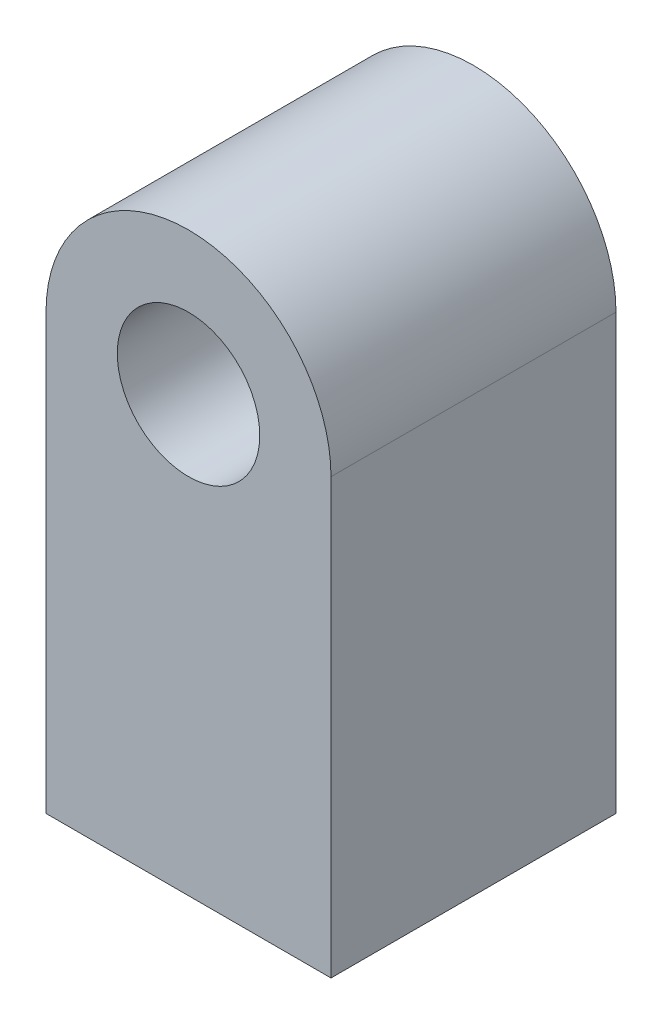
ISO-10303-21;
HEADER;
FILE_DESCRIPTION(('STEP AP214'),'2;1');
FILE_NAME('part.step','',(''),(''),'','','');
FILE_SCHEMA(('AUTOMOTIVE_DESIGN { 1 0 10303 214 1 1 1 1 }'));
ENDSEC;
DATA;
#1=APPLICATION_CONTEXT('core data for automotive mechanical design processes');
#2=APPLICATION_PROTOCOL_DEFINITION('international standard','automotive_design',2000,#1);
#3=PRODUCT_CONTEXT('',#1,'mechanical');
#4=PRODUCT('Part','Part','',(#3));
#5=PRODUCT_RELATED_PRODUCT_CATEGORY('part','',(#4));
#6=PRODUCT_DEFINITION_FORMATION('','',#4);
#7=PRODUCT_DEFINITION_CONTEXT('part definition',#1,'design');
#8=PRODUCT_DEFINITION('design','',#6,#7);
#9=PRODUCT_DEFINITION_SHAPE('','',#8);
#10=(LENGTH_UNIT() NAMED_UNIT(*) SI_UNIT(.MILLI.,.METRE.));
#11=(NAMED_UNIT(*) PLANE_ANGLE_UNIT() SI_UNIT($,.RADIAN.));
#12=(NAMED_UNIT(*) SI_UNIT($,.STERADIAN.) SOLID_ANGLE_UNIT());
#13=UNCERTAINTY_MEASURE_WITH_UNIT(LENGTH_MEASURE(1.E-05),#10,'distance_accuracy_value','');
#14=(GEOMETRIC_REPRESENTATION_CONTEXT(3) GLOBAL_UNCERTAINTY_ASSIGNED_CONTEXT((#13)) GLOBAL_UNIT_ASSIGNED_CONTEXT((#10,
#11,#12)) REPRESENTATION_CONTEXT('',''));
#15=CARTESIAN_POINT('',(0.,0.,0.));
#16=DIRECTION('',(0.,0.,1.));
#17=DIRECTION('',(1.,0.,0.));
#18=AXIS2_PLACEMENT_3D('',#15,#16,#17);
#19=CARTESIAN_POINT('',(0.,121.875,40.));
#20=DIRECTION('',(0.,0.,-1.));
#21=DIRECTION('',(-1.,0.,0.));
#22=AXIS2_PLACEMENT_3D('',#19,#20,#21);
#23=PLANE('',#22);
#24=DIRECTION('',(1.,0.,0.));
#25=VECTOR('',#24,1.);
#26=CARTESIAN_POINT('',(0.,0.,40.));
#27=LINE('',#26,#25);
#28=CARTESIAN_POINT('',(-40.,0.,40.));
#29=VERTEX_POINT('',#28);
#30=CARTESIAN_POINT('',(40.,0.,40.));
#31=VERTEX_POINT('',#30);
#32=EDGE_CURVE('E80',#29,#31,#27,.T.);
#33=ORIENTED_EDGE('',*,*,#32,.T.);
#34=DIRECTION('',(0.,1.,0.));
#35=VECTOR('',#34,1.);
#36=CARTESIAN_POINT('',(40.,0.,40.));
#37=LINE('',#36,#35);
#38=CARTESIAN_POINT('',(40.,121.875,40.));
#39=VERTEX_POINT('',#38);
#40=EDGE_CURVE('E83',#31,#39,#37,.T.);
#41=ORIENTED_EDGE('',*,*,#40,.T.);
#42=CARTESIAN_POINT('',(0.,121.875,40.));
#43=DIRECTION('',(0.,0.,1.));
#44=DIRECTION('',(-1.,0.,0.));
#45=AXIS2_PLACEMENT_3D('',#42,#43,#44);
#46=CIRCLE('',#45,40.);
#47=CARTESIAN_POINT('',(-40.,121.875,40.));
#48=VERTEX_POINT('',#47);
#49=EDGE_CURVE('E87',#39,#48,#46,.T.);
#50=ORIENTED_EDGE('',*,*,#49,.T.);
#51=DIRECTION('',(0.,-1.,0.));
#52=VECTOR('',#51,1.);
#53=CARTESIAN_POINT('',(-40.,0.,40.));
#54=LINE('',#53,#52);
#55=EDGE_CURVE('E51',#48,#29,#54,.T.);
#56=ORIENTED_EDGE('',*,*,#55,.T.);
#57=EDGE_LOOP('',(#33,#41,#50,#56));
#58=FACE_BOUND('',#57,.T.);
#59=CARTESIAN_POINT('',(0.,121.875,40.));
#60=DIRECTION('',(0.,0.,1.));
#61=DIRECTION('',(1.,0.,0.));
#62=AXIS2_PLACEMENT_3D('',#59,#60,#61);
#63=CIRCLE('',#62,20.);
#64=CARTESIAN_POINT('',(20.,121.875,40.));
#65=VERTEX_POINT('',#64);
#66=EDGE_CURVE('E100',#65,#65,#63,.T.);
#67=ORIENTED_EDGE('',*,*,#66,.F.);
#68=EDGE_LOOP('',(#67));
#69=FACE_BOUND('',#68,.T.);
#70=ADVANCED_FACE('F34',(#58,#69),#23,.F.);
#71=CARTESIAN_POINT('',(0.,121.875,-40.));
#72=DIRECTION('',(0.,0.,-1.));
#73=DIRECTION('',(-1.,0.,0.));
#74=AXIS2_PLACEMENT_3D('',#71,#72,#73);
#75=PLANE('',#74);
#76=DIRECTION('',(1.,0.,0.));
#77=VECTOR('',#76,1.);
#78=CARTESIAN_POINT('',(0.,0.,-40.));
#79=LINE('',#78,#77);
#80=CARTESIAN_POINT('',(-40.,0.,-40.));
#81=VERTEX_POINT('',#80);
#82=CARTESIAN_POINT('',(40.,0.,-40.));
#83=VERTEX_POINT('',#82);
#84=EDGE_CURVE('E75',#81,#83,#79,.T.);
#85=ORIENTED_EDGE('',*,*,#84,.F.);
#86=DIRECTION('',(0.,-1.,0.));
#87=VECTOR('',#86,1.);
#88=CARTESIAN_POINT('',(-40.,0.,-40.));
#89=LINE('',#88,#87);
#90=CARTESIAN_POINT('',(-40.,121.875,-40.));
#91=VERTEX_POINT('',#90);
#92=EDGE_CURVE('E103',#91,#81,#89,.T.);
#93=ORIENTED_EDGE('',*,*,#92,.F.);
#94=CARTESIAN_POINT('',(0.,121.875,-40.));
#95=DIRECTION('',(0.,0.,1.));
#96=DIRECTION('',(-1.,0.,0.));
#97=AXIS2_PLACEMENT_3D('',#94,#95,#96);
#98=CIRCLE('',#97,40.);
#99=CARTESIAN_POINT('',(40.,121.875,-40.));
#100=VERTEX_POINT('',#99);
#101=EDGE_CURVE('E68',#100,#91,#98,.T.);
#102=ORIENTED_EDGE('',*,*,#101,.F.);
#103=DIRECTION('',(0.,1.,0.));
#104=VECTOR('',#103,1.);
#105=CARTESIAN_POINT('',(40.,0.,-40.));
#106=LINE('',#105,#104);
#107=EDGE_CURVE('E91',#83,#100,#106,.T.);
#108=ORIENTED_EDGE('',*,*,#107,.F.);
#109=EDGE_LOOP('',(#85,#93,#102,#108));
#110=FACE_BOUND('',#109,.T.);
#111=CARTESIAN_POINT('',(0.,121.875,-40.));
#112=DIRECTION('',(0.,0.,1.));
#113=DIRECTION('',(1.,0.,0.));
#114=AXIS2_PLACEMENT_3D('',#111,#112,#113);
#115=CIRCLE('',#114,20.);
#116=CARTESIAN_POINT('',(20.,121.875,-40.));
#117=VERTEX_POINT('',#116);
#118=EDGE_CURVE('E115',#117,#117,#115,.T.);
#119=ORIENTED_EDGE('',*,*,#118,.T.);
#120=EDGE_LOOP('',(#119));
#121=FACE_BOUND('',#120,.T.);
#122=ADVANCED_FACE('F109',(#110,#121),#75,.T.);
#123=CARTESIAN_POINT('',(0.,0.,40.));
#124=DIRECTION('',(0.,1.,0.));
#125=DIRECTION('',(0.,0.,1.));
#126=AXIS2_PLACEMENT_3D('',#123,#124,#125);
#127=PLANE('',#126);
#128=CARTESIAN_POINT('',(0.,0.,0.));
#129=DIRECTION('',(0.,1.,0.));
#130=DIRECTION('',(0.,0.,1.));
#131=AXIS2_PLACEMENT_3D('',#128,#129,#130);
#132=CIRCLE('',#131,20.);
#133=CARTESIAN_POINT('',(0.,0.,20.));
#134=VERTEX_POINT('',#133);
#135=EDGE_CURVE('E122',#134,#134,#132,.T.);
#136=ORIENTED_EDGE('',*,*,#135,.T.);
#137=EDGE_LOOP('',(#136));
#138=FACE_BOUND('',#137,.T.);
#139=ORIENTED_EDGE('',*,*,#84,.T.);
#140=DIRECTION('',(0.,0.,-1.));
#141=VECTOR('',#140,1.);
#142=CARTESIAN_POINT('',(40.,0.,40.));
#143=LINE('',#142,#141);
#144=EDGE_CURVE('E11',#31,#83,#143,.T.);
#145=ORIENTED_EDGE('',*,*,#144,.F.);
#146=ORIENTED_EDGE('',*,*,#32,.F.);
#147=DIRECTION('',(0.,0.,-1.));
#148=VECTOR('',#147,1.);
#149=CARTESIAN_POINT('',(-40.,0.,40.));
#150=LINE('',#149,#148);
#151=EDGE_CURVE('E95',#29,#81,#150,.T.);
#152=ORIENTED_EDGE('',*,*,#151,.T.);
#153=EDGE_LOOP('',(#139,#145,#146,#152));
#154=FACE_BOUND('',#153,.T.);
#155=ADVANCED_FACE('F36',(#138,#154),#127,.F.);
#156=CARTESIAN_POINT('',(40.,0.,40.));
#157=DIRECTION('',(-1.,0.,0.));
#158=DIRECTION('',(0.,0.,1.));
#159=AXIS2_PLACEMENT_3D('',#156,#157,#158);
#160=PLANE('',#159);
#161=ORIENTED_EDGE('',*,*,#107,.T.);
#162=DIRECTION('',(0.,0.,-1.));
#163=VECTOR('',#162,1.);
#164=CARTESIAN_POINT('',(40.,121.875,40.));
#165=LINE('',#164,#163);
#166=EDGE_CURVE('E43',#39,#100,#165,.T.);
#167=ORIENTED_EDGE('',*,*,#166,.F.);
#168=ORIENTED_EDGE('',*,*,#40,.F.);
#169=ORIENTED_EDGE('',*,*,#144,.T.);
#170=EDGE_LOOP('',(#161,#167,#168,#169));
#171=FACE_BOUND('',#170,.T.);
#172=ADVANCED_FACE('F90',(#171),#160,.F.);
#173=CARTESIAN_POINT('',(0.,121.875,40.));
#174=DIRECTION('',(0.,0.,-1.));
#175=DIRECTION('',(-1.,0.,0.));
#176=AXIS2_PLACEMENT_3D('',#173,#174,#175);
#177=CYLINDRICAL_SURFACE('',#176,40.);
#178=ORIENTED_EDGE('',*,*,#101,.T.);
#179=DIRECTION('',(0.,0.,-1.));
#180=VECTOR('',#179,1.);
#181=CARTESIAN_POINT('',(-40.,121.875,40.));
#182=LINE('',#181,#180);
#183=EDGE_CURVE('E92',#48,#91,#182,.T.);
#184=ORIENTED_EDGE('',*,*,#183,.F.);
#185=ORIENTED_EDGE('',*,*,#49,.F.);
#186=ORIENTED_EDGE('',*,*,#166,.T.);
#187=EDGE_LOOP('',(#178,#184,#185,#186));
#188=FACE_BOUND('',#187,.T.);
#189=ADVANCED_FACE('F93',(#188),#177,.T.);
#190=CARTESIAN_POINT('',(-40.,0.,40.));
#191=DIRECTION('',(1.,0.,0.));
#192=DIRECTION('',(0.,0.,-1.));
#193=AXIS2_PLACEMENT_3D('',#190,#191,#192);
#194=PLANE('',#193);
#195=ORIENTED_EDGE('',*,*,#92,.T.);
#196=ORIENTED_EDGE('',*,*,#151,.F.);
#197=ORIENTED_EDGE('',*,*,#55,.F.);
#198=ORIENTED_EDGE('',*,*,#183,.T.);
#199=EDGE_LOOP('',(#195,#196,#197,#198));
#200=FACE_BOUND('',#199,.T.);
#201=ADVANCED_FACE('F108',(#200),#194,.F.);
#202=CARTESIAN_POINT('',(0.,121.875,40.));
#203=DIRECTION('',(0.,0.,-1.));
#204=DIRECTION('',(-1.,0.,0.));
#205=AXIS2_PLACEMENT_3D('',#202,#203,#204);
#206=CYLINDRICAL_SURFACE('',#205,20.);
#207=ORIENTED_EDGE('',*,*,#66,.T.);
#208=EDGE_LOOP('',(#207));
#209=FACE_BOUND('',#208,.T.);
#210=ORIENTED_EDGE('',*,*,#118,.F.);
#211=EDGE_LOOP('',(#210));
#212=FACE_BOUND('',#211,.T.);
#213=ADVANCED_FACE('F133',(#209,#212),#206,.F.);
#214=CARTESIAN_POINT('',(0.,40.,0.));
#215=DIRECTION('',(0.,-1.,0.));
#216=DIRECTION('',(0.,0.,-1.));
#217=AXIS2_PLACEMENT_3D('',#214,#215,#216);
#218=CYLINDRICAL_SURFACE('',#217,20.);
#219=CARTESIAN_POINT('',(0.,40.,0.));
#220=DIRECTION('',(0.,1.,0.));
#221=DIRECTION('',(0.,0.,1.));
#222=AXIS2_PLACEMENT_3D('',#219,#220,#221);
#223=CIRCLE('',#222,20.);
#224=CARTESIAN_POINT('',(0.,40.,20.));
#225=VERTEX_POINT('',#224);
#226=EDGE_CURVE('E117',#225,#225,#223,.T.);
#227=ORIENTED_EDGE('',*,*,#226,.T.);
#228=EDGE_LOOP('',(#227));
#229=FACE_BOUND('',#228,.T.);
#230=ORIENTED_EDGE('',*,*,#135,.F.);
#231=EDGE_LOOP('',(#230));
#232=FACE_BOUND('',#231,.T.);
#233=ADVANCED_FACE('F130',(#229,#232),#218,.F.);
#234=CARTESIAN_POINT('',(0.,40.,0.));
#235=DIRECTION('',(0.,1.,0.));
#236=DIRECTION('',(0.,0.,1.));
#237=AXIS2_PLACEMENT_3D('',#234,#235,#236);
#238=PLANE('',#237);
#239=ORIENTED_EDGE('',*,*,#226,.F.);
#240=EDGE_LOOP('',(#239));
#241=FACE_BOUND('',#240,.T.);
#242=ADVANCED_FACE('F132',(#241),#238,.F.);
#243=CLOSED_SHELL('',(#70,#122,#155,#172,#189,#201,#213,#233,#242));
#244=MANIFOLD_SOLID_BREP('B2',#243);
#245=ADVANCED_BREP_SHAPE_REPRESENTATION('',(#18,#244),#14);
#246=SHAPE_DEFINITION_REPRESENTATION(#9,#245);
ENDSEC;
END-ISO-10303-21;
